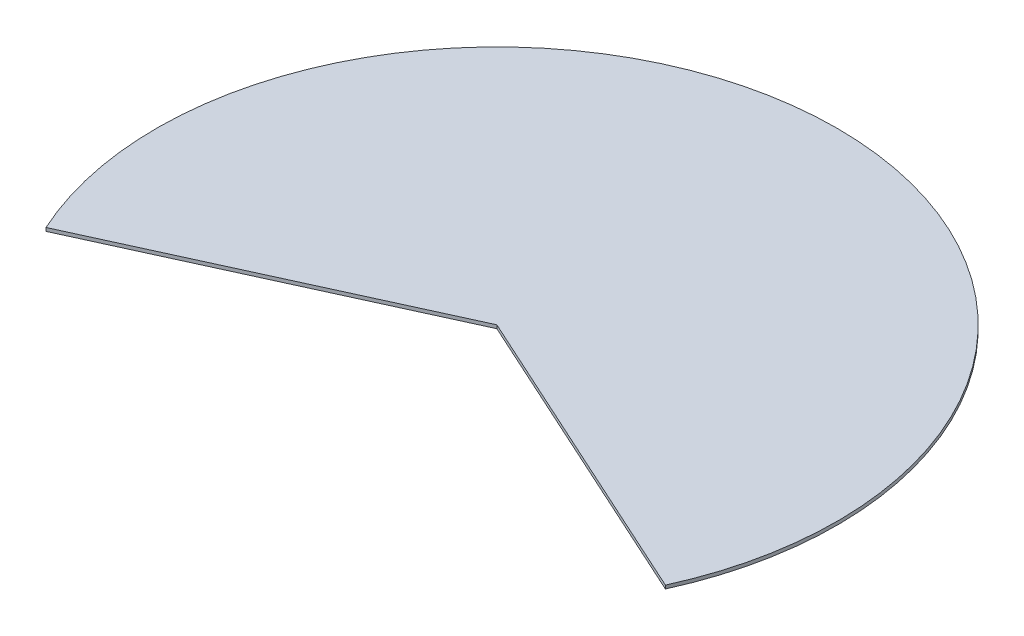
ISO-10303-21;
HEADER;
FILE_DESCRIPTION(('STEP AP214'),'2;1');
FILE_NAME('part.step','',(''),(''),'','','');
FILE_SCHEMA(('AUTOMOTIVE_DESIGN { 1 0 10303 214 1 1 1 1 }'));
ENDSEC;
DATA;
#1=APPLICATION_CONTEXT('core data for automotive mechanical design processes');
#2=APPLICATION_PROTOCOL_DEFINITION('international standard','automotive_design',2000,#1);
#3=PRODUCT_CONTEXT('',#1,'mechanical');
#4=PRODUCT('Part','Part','',(#3));
#5=PRODUCT_RELATED_PRODUCT_CATEGORY('part','',(#4));
#6=PRODUCT_DEFINITION_FORMATION('','',#4);
#7=PRODUCT_DEFINITION_CONTEXT('part definition',#1,'design');
#8=PRODUCT_DEFINITION('design','',#6,#7);
#9=PRODUCT_DEFINITION_SHAPE('','',#8);
#10=(LENGTH_UNIT() NAMED_UNIT(*) SI_UNIT(.MILLI.,.METRE.));
#11=(NAMED_UNIT(*) PLANE_ANGLE_UNIT() SI_UNIT($,.RADIAN.));
#12=(NAMED_UNIT(*) SI_UNIT($,.STERADIAN.) SOLID_ANGLE_UNIT());
#13=UNCERTAINTY_MEASURE_WITH_UNIT(LENGTH_MEASURE(1.E-05),#10,'distance_accuracy_value','');
#14=(GEOMETRIC_REPRESENTATION_CONTEXT(3) GLOBAL_UNCERTAINTY_ASSIGNED_CONTEXT((#13)) GLOBAL_UNIT_ASSIGNED_CONTEXT((#10,
#11,#12)) REPRESENTATION_CONTEXT('',''));
#15=CARTESIAN_POINT('',(0.,0.,0.));
#16=DIRECTION('',(0.,0.,1.));
#17=DIRECTION('',(1.,0.,0.));
#18=AXIS2_PLACEMENT_3D('',#15,#16,#17);
#19=CARTESIAN_POINT('',(0.,10.,0.));
#20=DIRECTION('',(0.41469324265624,0.,-0.909961270876543));
#21=DIRECTION('',(-0.909961270876543,0.,-0.41469324265624));
#22=AXIS2_PLACEMENT_3D('',#19,#20,#21);
#23=PLANE('',#22);
#24=DIRECTION('',(0.909961270876543,0.,0.41469324265624));
#25=VECTOR('',#24,1.);
#26=CARTESIAN_POINT('',(0.,0.,0.));
#27=LINE('',#26,#25);
#28=CARTESIAN_POINT('',(0.,0.,0.));
#29=VERTEX_POINT('',#28);
#30=CARTESIAN_POINT('',(909.961270876542,0.,414.693242656241));
#31=VERTEX_POINT('',#30);
#32=EDGE_CURVE('E84',#29,#31,#27,.T.);
#33=ORIENTED_EDGE('',*,*,#32,.T.);
#34=DIRECTION('',(0.,-1.,0.));
#35=VECTOR('',#34,1.);
#36=CARTESIAN_POINT('',(909.961270876542,10.,414.693242656241));
#37=LINE('',#36,#35);
#38=CARTESIAN_POINT('',(909.961270876542,10.,414.693242656241));
#39=VERTEX_POINT('',#38);
#40=EDGE_CURVE('E11',#39,#31,#37,.T.);
#41=ORIENTED_EDGE('',*,*,#40,.F.);
#42=DIRECTION('',(0.909961270876543,0.,0.41469324265624));
#43=VECTOR('',#42,1.);
#44=CARTESIAN_POINT('',(0.,10.,0.));
#45=LINE('',#44,#43);
#46=CARTESIAN_POINT('',(0.,10.,0.));
#47=VERTEX_POINT('',#46);
#48=EDGE_CURVE('E77',#47,#39,#45,.T.);
#49=ORIENTED_EDGE('',*,*,#48,.F.);
#50=DIRECTION('',(0.,-1.,0.));
#51=VECTOR('',#50,1.);
#52=CARTESIAN_POINT('',(0.,10.,0.));
#53=LINE('',#52,#51);
#54=EDGE_CURVE('E85',#47,#29,#53,.T.);
#55=ORIENTED_EDGE('',*,*,#54,.T.);
#56=EDGE_LOOP('',(#33,#41,#49,#55));
#57=FACE_BOUND('',#56,.T.);
#58=ADVANCED_FACE('F37',(#57),#23,.F.);
#59=CARTESIAN_POINT('',(0.,10.,0.));
#60=DIRECTION('',(0.,-1.,0.));
#61=DIRECTION('',(0.,0.,-1.));
#62=AXIS2_PLACEMENT_3D('',#59,#60,#61);
#63=CYLINDRICAL_SURFACE('',#62,1000.);
#64=CARTESIAN_POINT('',(0.,0.,0.));
#65=DIRECTION('',(0.,1.,0.));
#66=DIRECTION('',(0.,0.,-1.));
#67=AXIS2_PLACEMENT_3D('',#64,#65,#66);
#68=CIRCLE('',#67,1000.);
#69=CARTESIAN_POINT('',(-909.961270876543,0.,414.69324265624));
#70=VERTEX_POINT('',#69);
#71=EDGE_CURVE('E65',#31,#70,#68,.T.);
#72=ORIENTED_EDGE('',*,*,#71,.T.);
#73=DIRECTION('',(0.,-1.,0.));
#74=VECTOR('',#73,1.);
#75=CARTESIAN_POINT('',(-909.961270876543,10.,414.69324265624));
#76=LINE('',#75,#74);
#77=CARTESIAN_POINT('',(-909.961270876543,10.,414.69324265624));
#78=VERTEX_POINT('',#77);
#79=EDGE_CURVE('E45',#78,#70,#76,.T.);
#80=ORIENTED_EDGE('',*,*,#79,.F.);
#81=CARTESIAN_POINT('',(0.,10.,0.));
#82=DIRECTION('',(0.,1.,0.));
#83=DIRECTION('',(0.,0.,-1.));
#84=AXIS2_PLACEMENT_3D('',#81,#82,#83);
#85=CIRCLE('',#84,1000.);
#86=EDGE_CURVE('E73',#39,#78,#85,.T.);
#87=ORIENTED_EDGE('',*,*,#86,.F.);
#88=ORIENTED_EDGE('',*,*,#40,.T.);
#89=EDGE_LOOP('',(#72,#80,#87,#88));
#90=FACE_BOUND('',#89,.T.);
#91=ADVANCED_FACE('F74',(#90),#63,.T.);
#92=CARTESIAN_POINT('',(-909.961270876543,10.,414.69324265624));
#93=DIRECTION('',(-0.41469324265624,0.,-0.909961270876543));
#94=DIRECTION('',(-0.909961270876543,0.,0.41469324265624));
#95=AXIS2_PLACEMENT_3D('',#92,#93,#94);
#96=PLANE('',#95);
#97=DIRECTION('',(0.909961270876543,0.,-0.41469324265624));
#98=VECTOR('',#97,1.);
#99=CARTESIAN_POINT('',(-909.961270876543,0.,414.69324265624));
#100=LINE('',#99,#98);
#101=EDGE_CURVE('E70',#70,#29,#100,.T.);
#102=ORIENTED_EDGE('',*,*,#101,.T.);
#103=ORIENTED_EDGE('',*,*,#54,.F.);
#104=DIRECTION('',(0.909961270876543,0.,-0.41469324265624));
#105=VECTOR('',#104,1.);
#106=CARTESIAN_POINT('',(-909.961270876543,10.,414.69324265624));
#107=LINE('',#106,#105);
#108=EDGE_CURVE('E53',#78,#47,#107,.T.);
#109=ORIENTED_EDGE('',*,*,#108,.F.);
#110=ORIENTED_EDGE('',*,*,#79,.T.);
#111=EDGE_LOOP('',(#102,#103,#109,#110));
#112=FACE_BOUND('',#111,.T.);
#113=ADVANCED_FACE('F92',(#112),#96,.F.);
#114=CARTESIAN_POINT('',(0.,10.,0.));
#115=DIRECTION('',(0.,-1.,0.));
#116=DIRECTION('',(0.,0.,-1.));
#117=AXIS2_PLACEMENT_3D('',#114,#115,#116);
#118=PLANE('',#117);
#119=ORIENTED_EDGE('',*,*,#48,.T.);
#120=ORIENTED_EDGE('',*,*,#86,.T.);
#121=ORIENTED_EDGE('',*,*,#108,.T.);
#122=EDGE_LOOP('',(#119,#120,#121));
#123=FACE_BOUND('',#122,.T.);
#124=ADVANCED_FACE('F80',(#123),#118,.F.);
#125=CARTESIAN_POINT('',(0.,0.,0.));
#126=DIRECTION('',(0.,-1.,0.));
#127=DIRECTION('',(0.,0.,-1.));
#128=AXIS2_PLACEMENT_3D('',#125,#126,#127);
#129=PLANE('',#128);
#130=ORIENTED_EDGE('',*,*,#32,.F.);
#131=ORIENTED_EDGE('',*,*,#101,.F.);
#132=ORIENTED_EDGE('',*,*,#71,.F.);
#133=EDGE_LOOP('',(#130,#131,#132));
#134=FACE_BOUND('',#133,.T.);
#135=ADVANCED_FACE('F93',(#134),#129,.T.);
#136=CLOSED_SHELL('',(#58,#91,#113,#124,#135));
#137=MANIFOLD_SOLID_BREP('B2',#136);
#138=ADVANCED_BREP_SHAPE_REPRESENTATION('',(#18,#137),#14);
#139=SHAPE_DEFINITION_REPRESENTATION(#9,#138);
ENDSEC;
END-ISO-10303-21;
